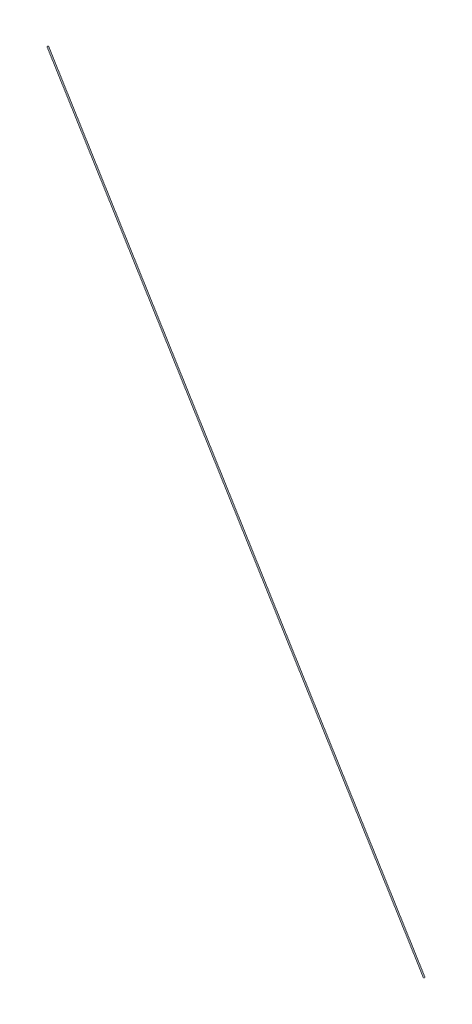
ISO-10303-21;
HEADER;
FILE_DESCRIPTION(('STEP AP214'),'2;1');
FILE_NAME('part.step','',(''),(''),'','','');
FILE_SCHEMA(('AUTOMOTIVE_DESIGN { 1 0 10303 214 1 1 1 1 }'));
ENDSEC;
DATA;
#1=APPLICATION_CONTEXT('core data for automotive mechanical design processes');
#2=APPLICATION_PROTOCOL_DEFINITION('international standard','automotive_design',2000,#1);
#3=PRODUCT_CONTEXT('',#1,'mechanical');
#4=PRODUCT('Part','Part','',(#3));
#5=PRODUCT_RELATED_PRODUCT_CATEGORY('part','',(#4));
#6=PRODUCT_DEFINITION_FORMATION('','',#4);
#7=PRODUCT_DEFINITION_CONTEXT('part definition',#1,'design');
#8=PRODUCT_DEFINITION('design','',#6,#7);
#9=PRODUCT_DEFINITION_SHAPE('','',#8);
#10=(LENGTH_UNIT() NAMED_UNIT(*) SI_UNIT(.MILLI.,.METRE.));
#11=(NAMED_UNIT(*) PLANE_ANGLE_UNIT() SI_UNIT($,.RADIAN.));
#12=(NAMED_UNIT(*) SI_UNIT($,.STERADIAN.) SOLID_ANGLE_UNIT());
#13=UNCERTAINTY_MEASURE_WITH_UNIT(LENGTH_MEASURE(1.E-05),#10,'distance_accuracy_value','');
#14=(GEOMETRIC_REPRESENTATION_CONTEXT(3) GLOBAL_UNCERTAINTY_ASSIGNED_CONTEXT((#13)) GLOBAL_UNIT_ASSIGNED_CONTEXT((#10,
#11,#12)) REPRESENTATION_CONTEXT('',''));
#15=CARTESIAN_POINT('',(0.,0.,0.));
#16=DIRECTION('',(0.,0.,1.));
#17=DIRECTION('',(1.,0.,0.));
#18=AXIS2_PLACEMENT_3D('',#15,#16,#17);
#19=CARTESIAN_POINT('',(307.5,0.,0.));
#20=DIRECTION('',(-0.520081079703551,0.854116895122904,0.));
#21=DIRECTION('',(-0.854116895122904,-0.520081079703551,0.));
#22=AXIS2_PLACEMENT_3D('',#19,#20,#21);
#23=PLANE('',#22);
#24=CARTESIAN_POINT('',(307.5,0.,0.));
#25=DIRECTION('',(-0.520081079703551,0.854116895122904,0.));
#26=DIRECTION('',(-0.854116895122904,-0.520081079703551,0.));
#27=AXIS2_PLACEMENT_3D('',#24,#25,#26);
#28=CIRCLE('',#27,0.500000000000014);
#29=CARTESIAN_POINT('',(307.072941552439,-0.260040539851782,0.));
#30=VERTEX_POINT('',#29);
#31=EDGE_CURVE('E52',#30,#30,#28,.T.);
#32=ORIENTED_EDGE('',*,*,#31,.F.);
#33=EDGE_LOOP('',(#32));
#34=FACE_BOUND('',#33,.T.);
#35=ADVANCED_FACE('F45',(#34),#23,.F.);
#36=CARTESIAN_POINT('',(0.,505.,0.));
#37=DIRECTION('',(-0.520081079703551,0.854116895122904,0.));
#38=DIRECTION('',(-0.854116895122904,-0.520081079703551,0.));
#39=AXIS2_PLACEMENT_3D('',#36,#37,#38);
#40=PLANE('',#39);
#41=CARTESIAN_POINT('',(0.,505.,0.));
#42=DIRECTION('',(-0.520081079703551,0.854116895122904,0.));
#43=DIRECTION('',(-0.854116895122904,-0.520081079703551,0.));
#44=AXIS2_PLACEMENT_3D('',#41,#42,#43);
#45=CIRCLE('',#44,0.500000000000014);
#46=CARTESIAN_POINT('',(-0.427058447561464,504.739959460148,0.));
#47=VERTEX_POINT('',#46);
#48=EDGE_CURVE('E11',#47,#47,#45,.T.);
#49=ORIENTED_EDGE('',*,*,#48,.T.);
#50=EDGE_LOOP('',(#49));
#51=FACE_BOUND('',#50,.T.);
#52=ADVANCED_FACE('F62',(#51),#40,.T.);
#53=CARTESIAN_POINT('',(307.5,0.,0.));
#54=DIRECTION('',(-0.52008107970355,0.854116895122904,0.));
#55=DIRECTION('',(-0.854116895122904,-0.52008107970355,0.));
#56=AXIS2_PLACEMENT_3D('',#53,#54,#55);
#57=CYLINDRICAL_SURFACE('',#56,0.500000000000014);
#58=ORIENTED_EDGE('',*,*,#48,.F.);
#59=EDGE_LOOP('',(#58));
#60=FACE_BOUND('',#59,.T.);
#61=ORIENTED_EDGE('',*,*,#31,.T.);
#62=EDGE_LOOP('',(#61));
#63=FACE_BOUND('',#62,.T.);
#64=ADVANCED_FACE('F59',(#60,#63),#57,.T.);
#65=CLOSED_SHELL('',(#35,#52,#64));
#66=MANIFOLD_SOLID_BREP('B2',#65);
#67=ADVANCED_BREP_SHAPE_REPRESENTATION('',(#18,#66),#14);
#68=SHAPE_DEFINITION_REPRESENTATION(#9,#67);
ENDSEC;
END-ISO-10303-21;
